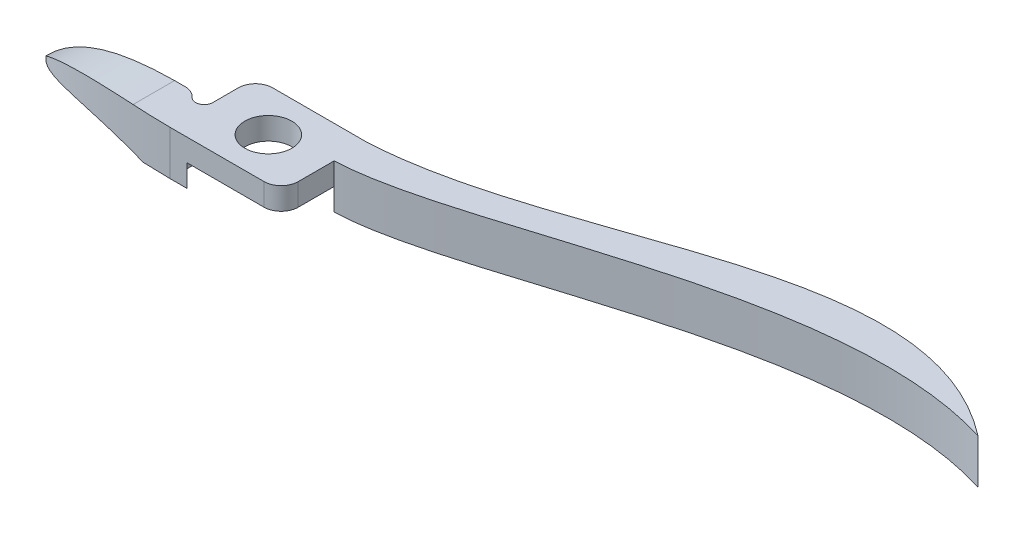
ISO-10303-21;
HEADER;
FILE_DESCRIPTION(('STEP AP214'),'2;1');
FILE_NAME('part.step','',(''),(''),'','','');
FILE_SCHEMA(('AUTOMOTIVE_DESIGN { 1 0 10303 214 1 1 1 1 }'));
ENDSEC;
DATA;
#1=APPLICATION_CONTEXT('core data for automotive mechanical design processes');
#2=APPLICATION_PROTOCOL_DEFINITION('international standard','automotive_design',2000,#1);
#3=PRODUCT_CONTEXT('',#1,'mechanical');
#4=PRODUCT('Part','Part','',(#3));
#5=PRODUCT_RELATED_PRODUCT_CATEGORY('part','',(#4));
#6=PRODUCT_DEFINITION_FORMATION('','',#4);
#7=PRODUCT_DEFINITION_CONTEXT('part definition',#1,'design');
#8=PRODUCT_DEFINITION('design','',#6,#7);
#9=PRODUCT_DEFINITION_SHAPE('','',#8);
#10=(LENGTH_UNIT() NAMED_UNIT(*) SI_UNIT(.MILLI.,.METRE.));
#11=(NAMED_UNIT(*) PLANE_ANGLE_UNIT() SI_UNIT($,.RADIAN.));
#12=(NAMED_UNIT(*) SI_UNIT($,.STERADIAN.) SOLID_ANGLE_UNIT());
#13=UNCERTAINTY_MEASURE_WITH_UNIT(LENGTH_MEASURE(1.E-05),#10,'distance_accuracy_value','');
#14=(GEOMETRIC_REPRESENTATION_CONTEXT(3) GLOBAL_UNCERTAINTY_ASSIGNED_CONTEXT((#13)) GLOBAL_UNIT_ASSIGNED_CONTEXT((#10,
#11,#12)) REPRESENTATION_CONTEXT('',''));
#15=CARTESIAN_POINT('',(0.,0.,0.));
#16=DIRECTION('',(0.,0.,1.));
#17=DIRECTION('',(1.,0.,0.));
#18=AXIS2_PLACEMENT_3D('',#15,#16,#17);
#19=CARTESIAN_POINT('',(-33.02,3.302,0.));
#20=CARTESIAN_POINT('',(-27.473096432597,3.302,6.22315986098551));
#21=CARTESIAN_POINT('',(-8.25499999999994,3.302,6.35));
#22=B_SPLINE_CURVE_WITH_KNOTS('',2,(#19,#20,#21),.UNSPECIFIED.,.F.,.F.,(3,3),(0.,1.),.UNSPECIFIED.);
#23=DIRECTION('',(0.,-1.,0.));
#24=VECTOR('',#23,1.);
#25=SURFACE_OF_LINEAR_EXTRUSION('',#22,#24);
#26=CARTESIAN_POINT('',(-33.02,-3.302,0.));
#27=CARTESIAN_POINT('',(-32.8493555262715,-3.23191102492854,0.191455572994813));
#28=CARTESIAN_POINT('',(-32.6712803221036,-3.16155099042531,0.376019685814025));
#29=CARTESIAN_POINT('',(-32.3025351047692,-3.02195048612788,0.731394631001662));
#30=CARTESIAN_POINT('',(-32.1119030977583,-2.95270736218043,0.90224378043286));
#31=CARTESIAN_POINT('',(-31.7194535669216,-2.81663188346119,1.23119449922115));
#32=CARTESIAN_POINT('',(-31.5176448250329,-2.74979770220064,1.38930584388313));
#33=CARTESIAN_POINT('',(-31.1068493182955,-2.62039434555366,1.69168586506872));
#34=CARTESIAN_POINT('',(-30.8979869134394,-2.55778164907948,1.8361053594339));
#35=CARTESIAN_POINT('',(-30.4718438568277,-2.43668640106267,2.11414393303659));
#36=CARTESIAN_POINT('',(-30.2545575546513,-2.37820669867898,2.247755570668));
#37=CARTESIAN_POINT('',(-29.8127787966357,-2.26602928752205,2.50482036263928));
#38=CARTESIAN_POINT('',(-29.5882838594076,-2.21233324993849,2.62826996570179));
#39=CARTESIAN_POINT('',(-29.0436517980687,-2.09013085422312,2.91235027700613));
#40=CARTESIAN_POINT('',(-28.7206197167618,-2.02410391595905,3.06851212350615));
#41=CARTESIAN_POINT('',(-28.0650059223243,-1.90314649690615,3.364153441573));
#42=CARTESIAN_POINT('',(-27.7324231650492,-1.84821723470581,3.50363108043291));
#43=CARTESIAN_POINT('',(-27.0596615216333,-1.74995444906151,3.76752460909254));
#44=CARTESIAN_POINT('',(-26.7194822372107,-1.70662153516172,3.89193970696487));
#45=CARTESIAN_POINT('',(-26.0307843289083,-1.63155871849199,4.12798692476388));
#46=CARTESIAN_POINT('',(-25.6822239339008,-1.59991238080401,4.23952320494405));
#47=CARTESIAN_POINT('',(-24.98053310519,-1.54876460290087,4.4501245389337));
#48=CARTESIAN_POINT('',(-24.6274031652878,-1.52926186141048,4.54919092807529));
#49=CARTESIAN_POINT('',(-23.9177111112223,-1.50240526794628,4.73606166228489));
#50=CARTESIAN_POINT('',(-23.5611487003343,-1.49505247595175,4.82386502413376));
#51=CARTESIAN_POINT('',(-22.6870108133602,-1.49188291053913,5.02593894914872));
#52=CARTESIAN_POINT('',(-22.1681212620189,-1.50262419495208,5.13469000922816));
#53=CARTESIAN_POINT('',(-21.1277968536637,-1.54914823001965,5.33374447517758));
#54=CARTESIAN_POINT('',(-20.6063611222535,-1.58494028706327,5.42404100905893));
#55=CARTESIAN_POINT('',(-19.5630919705991,-1.68143571779502,5.5885115446547));
#56=CARTESIAN_POINT('',(-19.0412584760049,-1.7421472613305,5.66268024665257));
#57=CARTESIAN_POINT('',(-18.0006763670951,-1.88827112310195,5.79667613792715));
#58=CARTESIAN_POINT('',(-17.4819232322313,-1.97361671213449,5.85654128271921));
#59=CARTESIAN_POINT('',(-16.4480455959767,-2.16921986273426,5.96387183841822));
#60=CARTESIAN_POINT('',(-15.9329198756559,-2.27946859934874,6.0113416290622));
#61=CARTESIAN_POINT('',(-14.9081383333329,-2.5252648857633,6.09536661321178));
#62=CARTESIAN_POINT('',(-14.3984793688402,-2.6607969752344,6.13192844142135));
#63=CARTESIAN_POINT('',(-13.6356505078139,-2.88471043582377,6.1798165038079));
#64=CARTESIAN_POINT('',(-13.3798295603584,-2.96342220284527,6.19470082326831));
#65=CARTESIAN_POINT('',(-12.8705555695267,-3.12759897118467,6.22214369241537));
#66=CARTESIAN_POINT('',(-12.6171001976962,-3.21305632055196,6.23470482485006));
#67=CARTESIAN_POINT('',(-12.3648063314247,-3.302,6.24619087496427));
#68=B_SPLINE_CURVE_WITH_KNOTS('',3,(#26,#27,#28,#29,#30,#31,#32,#33,#34,#35,#36,#37,#38,#39,#40,
#41,#42,#43,#44,#45,#46,#47,#48,#49,#50,#51,#52,#53,#54,#55,#56,#57,#58,#59,#60,#61,#62,#63,#64,
#65,#66,#67),.UNSPECIFIED.,.F.,.F.,(4,2,2,2,2,2,2,2,2,2,2,2,2,2,2,2,2,2,2,2,4),(0.,
0.797243659925846,1.5921762728664,2.38649290558763,3.17067983147115,3.9554021825044,
4.74039761265006,5.8340846084721,6.92789163220799,8.02175613893644,9.12329746767479,
10.2247207378736,11.3262400927683,12.9160146384745,14.5063801008409,16.0972673811179,
17.683885039876,19.2699413270169,20.8550309286911,21.6591486739592,22.4623670151177),.UNSPECIFIED.);
#69=CARTESIAN_POINT('',(-33.02,-3.302,0.));
#70=VERTEX_POINT('',#69);
#71=CARTESIAN_POINT('',(-12.3648063314247,-3.302,6.24619087474405));
#72=VERTEX_POINT('',#71);
#73=EDGE_CURVE('E367',#70,#72,#68,.T.);
#74=ORIENTED_EDGE('',*,*,#73,.T.);
#75=CARTESIAN_POINT('',(-33.02,-3.302,0.));
#76=CARTESIAN_POINT('',(-27.473096432597,-3.302,6.22315986098551));
#77=CARTESIAN_POINT('',(-8.25499999999994,-3.302,6.35));
#78=B_SPLINE_CURVE_WITH_KNOTS('',2,(#75,#76,#77),.UNSPECIFIED.,.F.,.F.,(3,3),(0.,1.),.UNSPECIFIED.);
#79=CARTESIAN_POINT('',(-8.255,-3.302,6.35));
#80=VERTEX_POINT('',#79);
#81=EDGE_CURVE('E230',#72,#80,#78,.T.);
#82=ORIENTED_EDGE('',*,*,#81,.T.);
#83=DIRECTION('',(0.,-1.,0.));
#84=VECTOR('',#83,1.);
#85=CARTESIAN_POINT('',(-8.255,3.302,6.35));
#86=LINE('',#85,#84);
#87=CARTESIAN_POINT('',(-8.255,3.302,6.35));
#88=VERTEX_POINT('',#87);
#89=EDGE_CURVE('E12',#88,#80,#86,.T.);
#90=ORIENTED_EDGE('',*,*,#89,.F.);
#91=CARTESIAN_POINT('',(-13.9218789110866,3.302,6.16184275451109));
#92=VERTEX_POINT('',#91);
#93=EDGE_CURVE('E119',#92,#88,#22,.T.);
#94=ORIENTED_EDGE('',*,*,#93,.F.);
#95=CARTESIAN_POINT('',(-13.9218789124482,3.30199999999994,6.16184275442513));
#96=CARTESIAN_POINT('',(-14.2757671587917,3.29807497459123,6.13949608522975));
#97=CARTESIAN_POINT('',(-14.6295015111341,3.29136135651999,6.11493106148992));
#98=CARTESIAN_POINT('',(-15.3366087323922,3.27172918300036,6.06100204686159));
#99=CARTESIAN_POINT('',(-15.6899813289981,3.25880749965579,6.03163564175186));
#100=CARTESIAN_POINT('',(-16.3959994084621,3.22613203775718,5.96775932544116));
#101=CARTESIAN_POINT('',(-16.7486447916846,3.20637737843231,5.93324875148313));
#102=CARTESIAN_POINT('',(-17.4580411622674,3.15900622958598,5.85814840924013));
#103=CARTESIAN_POINT('',(-17.8147761088024,3.13127821935011,5.81747658076509));
#104=CARTESIAN_POINT('',(-18.5267113011566,3.06732813468706,5.73000297352161));
#105=CARTESIAN_POINT('',(-18.8819116829497,3.03110682923011,5.6832017498687));
#106=CARTESIAN_POINT('',(-19.5903436081505,2.94936608040122,5.58298672496345));
#107=CARTESIAN_POINT('',(-19.9435748942931,2.90384545001304,5.52957207988138));
#108=CARTESIAN_POINT('',(-20.9588693978903,2.75792312557478,5.36521976693141));
#109=CARTESIAN_POINT('',(-21.6177092734333,2.64459484661716,5.24519587284131));
#110=CARTESIAN_POINT('',(-22.9212409606309,2.37628903121111,4.97615102574847));
#111=CARTESIAN_POINT('',(-23.5659305656395,2.22130504803414,4.82712558538847));
#112=CARTESIAN_POINT('',(-24.5148456016645,1.95450407200476,4.5794789719765));
#113=CARTESIAN_POINT('',(-24.827281708654,1.86016099940604,4.49318678844737));
#114=CARTESIAN_POINT('',(-25.4457787481901,1.65954853111274,4.31201146063032));
#115=CARTESIAN_POINT('',(-25.7518401045091,1.55327993120707,4.2171288896594));
#116=CARTESIAN_POINT('',(-26.3562691562426,1.3285915750584,4.01837020127277));
#117=CARTESIAN_POINT('',(-26.6546415329946,1.2101794419542,3.91449973235874));
#118=CARTESIAN_POINT('',(-27.2427587399877,0.96105209364033,3.69724172298386));
#119=CARTESIAN_POINT('',(-27.5325013541418,0.830333753500432,3.58385176602319));
#120=CARTESIAN_POINT('',(-28.218188902479,0.501000832942753,3.29886873251786));
#121=CARTESIAN_POINT('',(-28.6092813352912,0.296430002012325,3.12239130748748));
#122=CARTESIAN_POINT('',(-29.3683118481942,-0.135187222642011,2.74855160140704));
#123=CARTESIAN_POINT('',(-29.736257799875,-0.362225907233564,2.55119648228405));
#124=CARTESIAN_POINT('',(-30.209246604749,-0.677854162499141,2.27328886095922));
#125=CARTESIAN_POINT('',(-30.326002609069,-0.757819711930135,2.20259678842238));
#126=CARTESIAN_POINT('',(-30.5564976798568,-0.919752956621392,2.05868065779664));
#127=CARTESIAN_POINT('',(-30.6702372341323,-1.00172032398679,1.98545701356958));
#128=CARTESIAN_POINT('',(-31.0067870383155,-1.25039514132633,1.76188373463237));
#129=CARTESIAN_POINT('',(-31.2249605511133,-1.41989678983368,1.60761294884932));
#130=CARTESIAN_POINT('',(-31.6480344075935,-1.76467540864734,1.28806972880975));
#131=CARTESIAN_POINT('',(-31.8529425468534,-1.93994889398182,1.12280387390457));
#132=CARTESIAN_POINT('',(-32.1371239105262,-2.19432896995792,0.877014181604712));
#133=CARTESIAN_POINT('',(-32.2220217739333,-2.27186889567472,0.801317318518548));
#134=CARTESIAN_POINT('',(-32.3891206021983,-2.42748608680543,0.64758228583718));
#135=CARTESIAN_POINT('',(-32.4713221307051,-2.50556323573488,0.569544612185622));
#136=CARTESIAN_POINT('',(-32.7136458577688,-2.74013854204914,0.331907773391245));
#137=CARTESIAN_POINT('',(-32.86967332583,-2.89714783756021,0.168624454743414));
#138=CARTESIAN_POINT('',(-33.02,-3.05399492699543,0.));
#139=B_SPLINE_CURVE_WITH_KNOTS('',3,(#95,#96,#97,#98,#99,#100,#101,#102,#103,#104,#105,#106,
#107,#108,#109,#110,#111,#112,#113,#114,#115,#116,#117,#118,#119,#120,#121,#122,#123,#124,#125,
#126,#127,#128,#129,#130,#131,#132,#133,#134,#135,#136,#137,#138),.UNSPECIFIED.,.F.,.F.,(4,2,2,
2,2,2,2,2,2,2,2,2,2,2,2,2,2,2,2,2,2,4),(0.,1.06385184780087,2.12824027395346,3.19276595097234,
4.27297241019061,5.35308110686969,6.4333277607209,8.46918290407192,10.5053533024515,
11.5177893215878,12.5301578211261,13.5418946489719,14.5538890849416,15.9783987495692,
17.4024213224398,17.8769451441653,18.3513917540917,19.300156233718,20.2483580006092,
20.6612981518337,21.0741514236181,21.8989675965163),.UNSPECIFIED.);
#140=CARTESIAN_POINT('',(-33.02,-3.05399492699542,0.));
#141=VERTEX_POINT('',#140);
#142=EDGE_CURVE('E77',#92,#141,#139,.T.);
#143=ORIENTED_EDGE('',*,*,#142,.T.);
#144=DIRECTION('',(0.,-1.,0.));
#145=VECTOR('',#144,1.);
#146=CARTESIAN_POINT('',(-33.02,3.302,0.));
#147=LINE('',#146,#145);
#148=EDGE_CURVE('E183',#141,#70,#147,.T.);
#149=ORIENTED_EDGE('',*,*,#148,.T.);
#150=EDGE_LOOP('',(#74,#82,#90,#94,#143,#149));
#151=FACE_BOUND('',#150,.T.);
#152=ADVANCED_FACE('F60',(#151),#25,.F.);
#153=CARTESIAN_POINT('',(0.,3.302,0.));
#154=DIRECTION('',(0.,0.,1.));
#155=DIRECTION('',(1.,0.,0.));
#156=AXIS2_PLACEMENT_3D('',#153,#154,#155);
#157=PLANE('',#156);
#158=CARTESIAN_POINT('',(-12.3648063314247,-3.302,0.));
#159=CARTESIAN_POINT('',(-18.8048744708733,-1.03148335701843,0.));
#160=CARTESIAN_POINT('',(-26.8124714422319,-0.753963495491612,0.));
#161=CARTESIAN_POINT('',(-33.02,-3.30200000000001,0.));
#162=B_SPLINE_CURVE_WITH_KNOTS('',3,(#158,#159,#160,#161),.UNSPECIFIED.,.F.,.F.,(4,4),(0.,1.),.UNSPECIFIED.);
#163=CARTESIAN_POINT('',(-12.3648063314247,-3.302,0.));
#164=VERTEX_POINT('',#163);
#165=EDGE_CURVE('E378',#164,#70,#162,.T.);
#166=ORIENTED_EDGE('',*,*,#165,.T.);
#167=ORIENTED_EDGE('',*,*,#148,.F.);
#168=CARTESIAN_POINT('',(-33.02,-3.05399492699543,0.));
#169=CARTESIAN_POINT('',(-28.2378330119546,1.93464903660238,0.));
#170=CARTESIAN_POINT('',(-21.2907050841812,3.39591165007092,0.));
#171=CARTESIAN_POINT('',(-12.3648063314247,3.302,0.));
#172=B_SPLINE_CURVE_WITH_KNOTS('',3,(#168,#169,#170,#171),.UNSPECIFIED.,.F.,.F.,(4,4),(0.,1.),.UNSPECIFIED.);
#173=CARTESIAN_POINT('',(-13.9218789124441,3.302,0.));
#174=VERTEX_POINT('',#173);
#175=EDGE_CURVE('E209',#141,#174,#172,.T.);
#176=ORIENTED_EDGE('',*,*,#175,.T.);
#177=DIRECTION('',(-1.,0.,0.));
#178=VECTOR('',#177,1.);
#179=CARTESIAN_POINT('',(0.,3.302,0.));
#180=LINE('',#179,#178);
#181=CARTESIAN_POINT('',(-12.3648063314247,3.302,0.));
#182=VERTEX_POINT('',#181);
#183=EDGE_CURVE('E175',#182,#174,#180,.T.);
#184=ORIENTED_EDGE('',*,*,#183,.F.);
#185=DIRECTION('',(0.,-1.,0.));
#186=VECTOR('',#185,1.);
#187=CARTESIAN_POINT('',(-12.3648063314247,3.302,0.));
#188=LINE('',#187,#186);
#189=EDGE_CURVE('E86',#182,#164,#188,.T.);
#190=ORIENTED_EDGE('',*,*,#189,.T.);
#191=EDGE_LOOP('',(#166,#167,#176,#184,#190));
#192=FACE_BOUND('',#191,.T.);
#193=ADVANCED_FACE('F357',(#192),#157,.F.);
#194=CARTESIAN_POINT('',(0.,-3.302,0.));
#195=DIRECTION('',(0.,1.,0.));
#196=DIRECTION('',(0.,0.,1.));
#197=AXIS2_PLACEMENT_3D('',#194,#195,#196);
#198=PLANE('',#197);
#199=DIRECTION('',(0.,0.,-1.));
#200=VECTOR('',#199,1.);
#201=CARTESIAN_POINT('',(-12.3648063314247,-3.302,6.351));
#202=LINE('',#201,#200);
#203=EDGE_CURVE('E218',#72,#164,#202,.T.);
#204=ORIENTED_EDGE('',*,*,#203,.T.);
#205=CARTESIAN_POINT('',(-12.3648063314247,-3.302,2.54));
#206=DIRECTION('',(0.,1.,0.));
#207=DIRECTION('',(0.,0.,1.));
#208=AXIS2_PLACEMENT_3D('',#205,#206,#207);
#209=CIRCLE('',#208,2.54);
#210=CARTESIAN_POINT('',(-10.4716021104749,-3.302,0.846666666666668));
#211=VERTEX_POINT('',#210);
#212=EDGE_CURVE('E253',#164,#211,#209,.F.);
#213=ORIENTED_EDGE('',*,*,#212,.T.);
#214=CARTESIAN_POINT('',(-9.525,-3.302,0.));
#215=DIRECTION('',(0.,1.,0.));
#216=DIRECTION('',(0.,0.,1.));
#217=AXIS2_PLACEMENT_3D('',#214,#215,#216);
#218=CIRCLE('',#217,1.27);
#219=CARTESIAN_POINT('',(-8.255,-3.302,0.));
#220=VERTEX_POINT('',#219);
#221=EDGE_CURVE('E250',#211,#220,#218,.T.);
#222=ORIENTED_EDGE('',*,*,#221,.T.);
#223=DIRECTION('',(0.,0.,1.));
#224=VECTOR('',#223,1.);
#225=CARTESIAN_POINT('',(-8.255,-3.302,0.));
#226=LINE('',#225,#224);
#227=CARTESIAN_POINT('',(-8.255,-3.302,3.80999999999998));
#228=VERTEX_POINT('',#227);
#229=EDGE_CURVE('E247',#220,#228,#226,.T.);
#230=ORIENTED_EDGE('',*,*,#229,.T.);
#231=CARTESIAN_POINT('',(-5.715,-3.302,3.81));
#232=DIRECTION('',(0.,1.,0.));
#233=DIRECTION('',(0.,0.,1.));
#234=AXIS2_PLACEMENT_3D('',#231,#232,#233);
#235=CIRCLE('',#234,2.54);
#236=CARTESIAN_POINT('',(-5.71499999999998,-3.302,6.35));
#237=VERTEX_POINT('',#236);
#238=EDGE_CURVE('E244',#228,#237,#235,.T.);
#239=ORIENTED_EDGE('',*,*,#238,.T.);
#240=DIRECTION('',(-1.,0.,0.));
#241=VECTOR('',#240,1.);
#242=CARTESIAN_POINT('',(0.,-3.302,6.35));
#243=LINE('',#242,#241);
#244=EDGE_CURVE('E238',#237,#80,#243,.T.);
#245=ORIENTED_EDGE('',*,*,#244,.T.);
#246=ORIENTED_EDGE('',*,*,#81,.F.);
#247=EDGE_LOOP('',(#204,#213,#222,#230,#239,#245,#246));
#248=FACE_BOUND('',#247,.T.);
#249=ADVANCED_FACE('F362',(#248),#198,.F.);
#250=CARTESIAN_POINT('',(0.,3.302,0.));
#251=DIRECTION('',(0.,1.,0.));
#252=DIRECTION('',(0.,0.,1.));
#253=AXIS2_PLACEMENT_3D('',#250,#251,#252);
#254=PLANE('',#253);
#255=CARTESIAN_POINT('',(0.,3.302,0.));
#256=DIRECTION('',(0.,1.,0.));
#257=DIRECTION('',(0.,0.,1.));
#258=AXIS2_PLACEMENT_3D('',#255,#256,#257);
#259=CIRCLE('',#258,3.4925);
#260=CARTESIAN_POINT('',(0.,3.302,3.4925));
#261=VERTEX_POINT('',#260);
#262=EDGE_CURVE('E180',#261,#261,#259,.T.);
#263=ORIENTED_EDGE('',*,*,#262,.F.);
#264=EDGE_LOOP('',(#263));
#265=FACE_BOUND('',#264,.T.);
#266=ORIENTED_EDGE('',*,*,#183,.T.);
#267=DIRECTION('',(0.,0.,-1.));
#268=VECTOR('',#267,1.);
#269=CARTESIAN_POINT('',(-13.9218789124441,3.302,6.351));
#270=LINE('',#269,#268);
#271=EDGE_CURVE('E207',#92,#174,#270,.T.);
#272=ORIENTED_EDGE('',*,*,#271,.F.);
#273=ORIENTED_EDGE('',*,*,#93,.T.);
#274=DIRECTION('',(1.,0.,0.));
#275=VECTOR('',#274,1.);
#276=CARTESIAN_POINT('',(0.,3.302,6.35));
#277=LINE('',#276,#275);
#278=CARTESIAN_POINT('',(5.71499999999998,3.302,6.35));
#279=VERTEX_POINT('',#278);
#280=EDGE_CURVE('E308',#88,#279,#277,.T.);
#281=ORIENTED_EDGE('',*,*,#280,.T.);
#282=CARTESIAN_POINT('',(5.715,3.302,3.81));
#283=DIRECTION('',(0.,1.,0.));
#284=DIRECTION('',(0.,0.,1.));
#285=AXIS2_PLACEMENT_3D('',#282,#283,#284);
#286=CIRCLE('',#285,2.54);
#287=CARTESIAN_POINT('',(8.255,3.302,3.80999999999998));
#288=VERTEX_POINT('',#287);
#289=EDGE_CURVE('E314',#279,#288,#286,.T.);
#290=ORIENTED_EDGE('',*,*,#289,.T.);
#291=DIRECTION('',(0.,0.,1.));
#292=VECTOR('',#291,1.);
#293=CARTESIAN_POINT('',(8.255,3.302,0.));
#294=LINE('',#293,#292);
#295=CARTESIAN_POINT('',(8.255,3.302,-1.524));
#296=VERTEX_POINT('',#295);
#297=EDGE_CURVE('E316',#296,#288,#294,.T.);
#298=ORIENTED_EDGE('',*,*,#297,.F.);
#299=CARTESIAN_POINT('',(8.255,3.302,-1.524));
#300=CARTESIAN_POINT('',(26.9221441817597,3.302,-2.15084961746132));
#301=CARTESIAN_POINT('',(62.6462462616133,3.302,-22.822886737911));
#302=CARTESIAN_POINT('',(91.4400000000001,3.302,-13.97));
#303=B_SPLINE_CURVE_WITH_KNOTS('',3,(#299,#300,#301,#302),.UNSPECIFIED.,.F.,.F.,(4,4),(0.,1.),.UNSPECIFIED.);
#304=CARTESIAN_POINT('',(91.4400000000001,3.302,-13.97));
#305=VERTEX_POINT('',#304);
#306=EDGE_CURVE('E319',#296,#305,#303,.T.);
#307=ORIENTED_EDGE('',*,*,#306,.T.);
#308=CARTESIAN_POINT('',(91.44,3.302,-13.97));
#309=CARTESIAN_POINT('',(66.350363847713,3.302,-33.3520512179018));
#310=CARTESIAN_POINT('',(36.8413371265353,3.302,-7.76465399928655));
#311=CARTESIAN_POINT('',(8.25499999999984,3.302,-6.35));
#312=B_SPLINE_CURVE_WITH_KNOTS('',3,(#308,#309,#310,#311),.UNSPECIFIED.,.F.,.F.,(4,4),(0.,1.),.UNSPECIFIED.);
#313=CARTESIAN_POINT('',(8.255,3.302,-6.35));
#314=VERTEX_POINT('',#313);
#315=EDGE_CURVE('E324',#305,#314,#312,.T.);
#316=ORIENTED_EDGE('',*,*,#315,.T.);
#317=DIRECTION('',(1.,0.,0.));
#318=VECTOR('',#317,1.);
#319=CARTESIAN_POINT('',(0.,3.302,-6.35));
#320=LINE('',#319,#318);
#321=CARTESIAN_POINT('',(-5.71499999999998,3.302,-6.35));
#322=VERTEX_POINT('',#321);
#323=EDGE_CURVE('E435',#322,#314,#320,.T.);
#324=ORIENTED_EDGE('',*,*,#323,.F.);
#325=CARTESIAN_POINT('',(-5.715,3.302,-3.81));
#326=DIRECTION('',(0.,1.,0.));
#327=DIRECTION('',(0.,0.,1.));
#328=AXIS2_PLACEMENT_3D('',#325,#326,#327);
#329=CIRCLE('',#328,2.54);
#330=CARTESIAN_POINT('',(-8.255,3.302,-3.80999999999998));
#331=VERTEX_POINT('',#330);
#332=EDGE_CURVE('E155',#322,#331,#329,.T.);
#333=ORIENTED_EDGE('',*,*,#332,.T.);
#334=DIRECTION('',(0.,0.,1.));
#335=VECTOR('',#334,1.);
#336=CARTESIAN_POINT('',(-8.255,3.302,0.));
#337=LINE('',#336,#335);
#338=CARTESIAN_POINT('',(-8.255,3.302,0.));
#339=VERTEX_POINT('',#338);
#340=EDGE_CURVE('E146',#331,#339,#337,.T.);
#341=ORIENTED_EDGE('',*,*,#340,.T.);
#342=CARTESIAN_POINT('',(-9.525,3.302,0.));
#343=DIRECTION('',(0.,1.,0.));
#344=DIRECTION('',(0.,0.,1.));
#345=AXIS2_PLACEMENT_3D('',#342,#343,#344);
#346=CIRCLE('',#345,1.27);
#347=CARTESIAN_POINT('',(-10.4716021104749,3.302,0.846666666666668));
#348=VERTEX_POINT('',#347);
#349=EDGE_CURVE('E152',#348,#339,#346,.T.);
#350=ORIENTED_EDGE('',*,*,#349,.F.);
#351=CARTESIAN_POINT('',(-12.3648063314247,3.302,2.54));
#352=DIRECTION('',(0.,1.,0.));
#353=DIRECTION('',(0.,0.,1.));
#354=AXIS2_PLACEMENT_3D('',#351,#352,#353);
#355=CIRCLE('',#354,2.54);
#356=EDGE_CURVE('E173',#182,#348,#355,.F.);
#357=ORIENTED_EDGE('',*,*,#356,.F.);
#358=EDGE_LOOP('',(#266,#272,#273,#281,#290,#298,#307,#316,#324,#333,#341,#350,#357));
#359=FACE_BOUND('',#358,.T.);
#360=ADVANCED_FACE('F149',(#265,#359),#254,.T.);
#361=CARTESIAN_POINT('',(0.,0.,0.));
#362=DIRECTION('',(0.,1.,0.));
#363=DIRECTION('',(0.,0.,1.));
#364=AXIS2_PLACEMENT_3D('',#361,#362,#363);
#365=PLANE('',#364);
#366=CARTESIAN_POINT('',(0.,0.,0.));
#367=DIRECTION('',(0.,1.,0.));
#368=DIRECTION('',(0.,0.,1.));
#369=AXIS2_PLACEMENT_3D('',#366,#367,#368);
#370=CIRCLE('',#369,3.4925);
#371=CARTESIAN_POINT('',(0.,0.,3.4925));
#372=VERTEX_POINT('',#371);
#373=EDGE_CURVE('E198',#372,#372,#370,.T.);
#374=ORIENTED_EDGE('',*,*,#373,.T.);
#375=EDGE_LOOP('',(#374));
#376=FACE_BOUND('',#375,.T.);
#377=DIRECTION('',(0.,0.,1.));
#378=VECTOR('',#377,1.);
#379=CARTESIAN_POINT('',(-8.255,0.,0.));
#380=LINE('',#379,#378);
#381=CARTESIAN_POINT('',(-8.255,0.,0.));
#382=VERTEX_POINT('',#381);
#383=CARTESIAN_POINT('',(-8.255,0.,3.80999999999998));
#384=VERTEX_POINT('',#383);
#385=EDGE_CURVE('E213',#382,#384,#380,.T.);
#386=ORIENTED_EDGE('',*,*,#385,.F.);
#387=DIRECTION('',(0.,0.,1.));
#388=VECTOR('',#387,1.);
#389=CARTESIAN_POINT('',(-8.255,0.,0.));
#390=LINE('',#389,#388);
#391=CARTESIAN_POINT('',(-8.255,0.,-3.80999999999998));
#392=VERTEX_POINT('',#391);
#393=EDGE_CURVE('E164',#392,#382,#390,.T.);
#394=ORIENTED_EDGE('',*,*,#393,.F.);
#395=CARTESIAN_POINT('',(-5.715,0.,-3.81));
#396=DIRECTION('',(0.,1.,0.));
#397=DIRECTION('',(0.,0.,1.));
#398=AXIS2_PLACEMENT_3D('',#395,#396,#397);
#399=CIRCLE('',#398,2.54);
#400=CARTESIAN_POINT('',(-5.71499999999998,0.,-6.35));
#401=VERTEX_POINT('',#400);
#402=EDGE_CURVE('E111',#401,#392,#399,.T.);
#403=ORIENTED_EDGE('',*,*,#402,.F.);
#404=DIRECTION('',(1.,0.,0.));
#405=VECTOR('',#404,1.);
#406=CARTESIAN_POINT('',(0.,0.,-6.35));
#407=LINE('',#406,#405);
#408=CARTESIAN_POINT('',(5.71499999999998,0.,-6.35));
#409=VERTEX_POINT('',#408);
#410=EDGE_CURVE('E193',#401,#409,#407,.T.);
#411=ORIENTED_EDGE('',*,*,#410,.T.);
#412=CARTESIAN_POINT('',(5.715,0.,-3.81));
#413=DIRECTION('',(0.,1.,0.));
#414=DIRECTION('',(0.,0.,1.));
#415=AXIS2_PLACEMENT_3D('',#412,#413,#414);
#416=CIRCLE('',#415,2.54);
#417=CARTESIAN_POINT('',(8.255,0.,-3.80999999999998));
#418=VERTEX_POINT('',#417);
#419=EDGE_CURVE('E262',#409,#418,#416,.F.);
#420=ORIENTED_EDGE('',*,*,#419,.T.);
#421=DIRECTION('',(0.,0.,1.));
#422=VECTOR('',#421,1.);
#423=CARTESIAN_POINT('',(8.255,0.,0.));
#424=LINE('',#423,#422);
#425=CARTESIAN_POINT('',(8.255,0.,-1.524));
#426=VERTEX_POINT('',#425);
#427=EDGE_CURVE('E274',#418,#426,#424,.T.);
#428=ORIENTED_EDGE('',*,*,#427,.T.);
#429=DIRECTION('',(0.,0.,1.));
#430=VECTOR('',#429,1.);
#431=CARTESIAN_POINT('',(8.255,0.,0.));
#432=LINE('',#431,#430);
#433=CARTESIAN_POINT('',(8.255,0.,3.80999999999998));
#434=VERTEX_POINT('',#433);
#435=EDGE_CURVE('E190',#426,#434,#432,.T.);
#436=ORIENTED_EDGE('',*,*,#435,.T.);
#437=CARTESIAN_POINT('',(5.715,0.,3.81));
#438=DIRECTION('',(0.,1.,0.));
#439=DIRECTION('',(0.,0.,1.));
#440=AXIS2_PLACEMENT_3D('',#437,#438,#439);
#441=CIRCLE('',#440,2.54);
#442=CARTESIAN_POINT('',(5.71499999999998,0.,6.35));
#443=VERTEX_POINT('',#442);
#444=EDGE_CURVE('E186',#443,#434,#441,.T.);
#445=ORIENTED_EDGE('',*,*,#444,.F.);
#446=DIRECTION('',(1.,0.,0.));
#447=VECTOR('',#446,1.);
#448=CARTESIAN_POINT('',(0.,0.,6.35));
#449=LINE('',#448,#447);
#450=CARTESIAN_POINT('',(-5.71499999999998,0.,6.35));
#451=VERTEX_POINT('',#450);
#452=EDGE_CURVE('E184',#451,#443,#449,.T.);
#453=ORIENTED_EDGE('',*,*,#452,.F.);
#454=CARTESIAN_POINT('',(-5.715,0.,3.81));
#455=DIRECTION('',(0.,1.,0.));
#456=DIRECTION('',(0.,0.,1.));
#457=AXIS2_PLACEMENT_3D('',#454,#455,#456);
#458=CIRCLE('',#457,2.54);
#459=EDGE_CURVE('E208',#384,#451,#458,.T.);
#460=ORIENTED_EDGE('',*,*,#459,.F.);
#461=EDGE_LOOP('',(#386,#394,#403,#411,#420,#428,#436,#445,#453,#460));
#462=FACE_BOUND('',#461,.T.);
#463=ADVANCED_FACE('F349',(#376,#462),#365,.F.);
#464=CARTESIAN_POINT('',(0.,3.302,6.35));
#465=DIRECTION('',(0.,0.,-1.));
#466=DIRECTION('',(-1.,0.,0.));
#467=AXIS2_PLACEMENT_3D('',#464,#465,#466);
#468=PLANE('',#467);
#469=ORIENTED_EDGE('',*,*,#89,.T.);
#470=ORIENTED_EDGE('',*,*,#244,.F.);
#471=DIRECTION('',(0.,1.,0.));
#472=VECTOR('',#471,1.);
#473=CARTESIAN_POINT('',(-5.71499999999998,-3.302,6.35));
#474=LINE('',#473,#472);
#475=EDGE_CURVE('E255',#237,#451,#474,.T.);
#476=ORIENTED_EDGE('',*,*,#475,.T.);
#477=ORIENTED_EDGE('',*,*,#452,.T.);
#478=DIRECTION('',(0.,-1.,0.));
#479=VECTOR('',#478,1.);
#480=CARTESIAN_POINT('',(5.71499999999998,3.302,6.35));
#481=LINE('',#480,#479);
#482=EDGE_CURVE('E69',#279,#443,#481,.T.);
#483=ORIENTED_EDGE('',*,*,#482,.F.);
#484=ORIENTED_EDGE('',*,*,#280,.F.);
#485=EDGE_LOOP('',(#469,#470,#476,#477,#483,#484));
#486=FACE_BOUND('',#485,.T.);
#487=ADVANCED_FACE('F346',(#486),#468,.F.);
#488=CARTESIAN_POINT('',(5.715,3.302,3.81));
#489=DIRECTION('',(0.,-1.,0.));
#490=DIRECTION('',(0.,0.,-1.));
#491=AXIS2_PLACEMENT_3D('',#488,#489,#490);
#492=CYLINDRICAL_SURFACE('',#491,2.54);
#493=ORIENTED_EDGE('',*,*,#444,.T.);
#494=DIRECTION('',(0.,-1.,0.));
#495=VECTOR('',#494,1.);
#496=CARTESIAN_POINT('',(8.255,3.302,3.80999999999998));
#497=LINE('',#496,#495);
#498=EDGE_CURVE('E453',#288,#434,#497,.T.);
#499=ORIENTED_EDGE('',*,*,#498,.F.);
#500=ORIENTED_EDGE('',*,*,#289,.F.);
#501=ORIENTED_EDGE('',*,*,#482,.T.);
#502=EDGE_LOOP('',(#493,#499,#500,#501));
#503=FACE_BOUND('',#502,.T.);
#504=ADVANCED_FACE('F343',(#503),#492,.T.);
#505=CARTESIAN_POINT('',(8.255,3.302,0.));
#506=DIRECTION('',(1.,0.,0.));
#507=DIRECTION('',(0.,0.,-1.));
#508=AXIS2_PLACEMENT_3D('',#505,#506,#507);
#509=PLANE('',#508);
#510=ORIENTED_EDGE('',*,*,#435,.F.);
#511=DIRECTION('',(0.,-1.,0.));
#512=VECTOR('',#511,1.);
#513=CARTESIAN_POINT('',(8.255,3.302,-1.524));
#514=LINE('',#513,#512);
#515=EDGE_CURVE('E448',#296,#426,#514,.T.);
#516=ORIENTED_EDGE('',*,*,#515,.F.);
#517=ORIENTED_EDGE('',*,*,#297,.T.);
#518=ORIENTED_EDGE('',*,*,#498,.T.);
#519=EDGE_LOOP('',(#510,#516,#517,#518));
#520=FACE_BOUND('',#519,.T.);
#521=ADVANCED_FACE('F338',(#520),#509,.T.);
#522=DIRECTION('',(0.,-1.,0.));
#523=VECTOR('',#522,1.);
#524=SURFACE_OF_LINEAR_EXTRUSION('',#303,#523);
#525=ORIENTED_EDGE('',*,*,#515,.T.);
#526=DIRECTION('',(0.,1.,0.));
#527=VECTOR('',#526,1.);
#528=CARTESIAN_POINT('',(8.255,-3.302,-1.524));
#529=LINE('',#528,#527);
#530=CARTESIAN_POINT('',(8.255,-3.302,-1.524));
#531=VERTEX_POINT('',#530);
#532=EDGE_CURVE('E187',#531,#426,#529,.T.);
#533=ORIENTED_EDGE('',*,*,#532,.F.);
#534=CARTESIAN_POINT('',(8.255,-3.302,-1.524));
#535=CARTESIAN_POINT('',(26.9221441817597,-3.302,-2.15084961746132));
#536=CARTESIAN_POINT('',(62.6462462616133,-3.302,-22.822886737911));
#537=CARTESIAN_POINT('',(91.4400000000001,-3.302,-13.97));
#538=B_SPLINE_CURVE_WITH_KNOTS('',3,(#534,#535,#536,#537),.UNSPECIFIED.,.F.,.F.,(4,4),(0.,1.),.UNSPECIFIED.);
#539=CARTESIAN_POINT('',(91.4400000000001,-3.302,-13.97));
#540=VERTEX_POINT('',#539);
#541=EDGE_CURVE('E268',#531,#540,#538,.T.);
#542=ORIENTED_EDGE('',*,*,#541,.T.);
#543=DIRECTION('',(0.,-1.,0.));
#544=VECTOR('',#543,1.);
#545=CARTESIAN_POINT('',(91.4400000000001,3.302,-13.97));
#546=LINE('',#545,#544);
#547=EDGE_CURVE('E446',#305,#540,#546,.T.);
#548=ORIENTED_EDGE('',*,*,#547,.F.);
#549=ORIENTED_EDGE('',*,*,#306,.F.);
#550=EDGE_LOOP('',(#525,#533,#542,#548,#549));
#551=FACE_BOUND('',#550,.T.);
#552=ADVANCED_FACE('F333',(#551),#524,.F.);
#553=DIRECTION('',(0.,-1.,0.));
#554=VECTOR('',#553,1.);
#555=SURFACE_OF_LINEAR_EXTRUSION('',#312,#554);
#556=ORIENTED_EDGE('',*,*,#547,.T.);
#557=CARTESIAN_POINT('',(91.44,-3.302,-13.97));
#558=CARTESIAN_POINT('',(66.350363847713,-3.302,-33.3520512179018));
#559=CARTESIAN_POINT('',(36.8413371265353,-3.302,-7.76465399928655));
#560=CARTESIAN_POINT('',(8.25499999999984,-3.302,-6.35));
#561=B_SPLINE_CURVE_WITH_KNOTS('',3,(#557,#558,#559,#560),.UNSPECIFIED.,.F.,.F.,(4,4),(0.,1.),.UNSPECIFIED.);
#562=CARTESIAN_POINT('',(8.255,-3.302,-6.35));
#563=VERTEX_POINT('',#562);
#564=EDGE_CURVE('E273',#540,#563,#561,.T.);
#565=ORIENTED_EDGE('',*,*,#564,.T.);
#566=DIRECTION('',(0.,-1.,0.));
#567=VECTOR('',#566,1.);
#568=CARTESIAN_POINT('',(8.255,3.302,-6.35));
#569=LINE('',#568,#567);
#570=EDGE_CURVE('E436',#314,#563,#569,.T.);
#571=ORIENTED_EDGE('',*,*,#570,.F.);
#572=ORIENTED_EDGE('',*,*,#315,.F.);
#573=EDGE_LOOP('',(#556,#565,#571,#572));
#574=FACE_BOUND('',#573,.T.);
#575=ADVANCED_FACE('F337',(#574),#555,.F.);
#576=CARTESIAN_POINT('',(0.,3.302,-6.35));
#577=DIRECTION('',(0.,0.,-1.));
#578=DIRECTION('',(-1.,0.,0.));
#579=AXIS2_PLACEMENT_3D('',#576,#577,#578);
#580=PLANE('',#579);
#581=ORIENTED_EDGE('',*,*,#410,.F.);
#582=DIRECTION('',(0.,-1.,0.));
#583=VECTOR('',#582,1.);
#584=CARTESIAN_POINT('',(-5.71499999999998,3.302,-6.35));
#585=LINE('',#584,#583);
#586=EDGE_CURVE('E434',#322,#401,#585,.T.);
#587=ORIENTED_EDGE('',*,*,#586,.F.);
#588=ORIENTED_EDGE('',*,*,#323,.T.);
#589=ORIENTED_EDGE('',*,*,#570,.T.);
#590=DIRECTION('',(1.,0.,0.));
#591=VECTOR('',#590,1.);
#592=CARTESIAN_POINT('',(0.,-3.302,-6.35));
#593=LINE('',#592,#591);
#594=CARTESIAN_POINT('',(5.71499999999998,-3.302,-6.35));
#595=VERTEX_POINT('',#594);
#596=EDGE_CURVE('E282',#595,#563,#593,.T.);
#597=ORIENTED_EDGE('',*,*,#596,.F.);
#598=DIRECTION('',(0.,1.,0.));
#599=VECTOR('',#598,1.);
#600=CARTESIAN_POINT('',(5.71499999999998,-3.302,-6.35));
#601=LINE('',#600,#599);
#602=EDGE_CURVE('E294',#595,#409,#601,.T.);
#603=ORIENTED_EDGE('',*,*,#602,.T.);
#604=EDGE_LOOP('',(#581,#587,#588,#589,#597,#603));
#605=FACE_BOUND('',#604,.T.);
#606=ADVANCED_FACE('F432',(#605),#580,.T.);
#607=CARTESIAN_POINT('',(-5.715,3.302,-3.81));
#608=DIRECTION('',(0.,-1.,0.));
#609=DIRECTION('',(0.,0.,-1.));
#610=AXIS2_PLACEMENT_3D('',#607,#608,#609);
#611=CYLINDRICAL_SURFACE('',#610,2.54);
#612=ORIENTED_EDGE('',*,*,#402,.T.);
#613=DIRECTION('',(0.,-1.,0.));
#614=VECTOR('',#613,1.);
#615=CARTESIAN_POINT('',(-8.255,3.302,-3.80999999999998));
#616=LINE('',#615,#614);
#617=EDGE_CURVE('E167',#331,#392,#616,.T.);
#618=ORIENTED_EDGE('',*,*,#617,.F.);
#619=ORIENTED_EDGE('',*,*,#332,.F.);
#620=ORIENTED_EDGE('',*,*,#586,.T.);
#621=EDGE_LOOP('',(#612,#618,#619,#620));
#622=FACE_BOUND('',#621,.T.);
#623=ADVANCED_FACE('F438',(#622),#611,.T.);
#624=CARTESIAN_POINT('',(-8.255,3.302,0.));
#625=DIRECTION('',(1.,0.,0.));
#626=DIRECTION('',(0.,0.,-1.));
#627=AXIS2_PLACEMENT_3D('',#624,#625,#626);
#628=PLANE('',#627);
#629=ORIENTED_EDGE('',*,*,#393,.T.);
#630=DIRECTION('',(0.,-1.,0.));
#631=VECTOR('',#630,1.);
#632=CARTESIAN_POINT('',(-8.255,3.302,0.));
#633=LINE('',#632,#631);
#634=EDGE_CURVE('E160',#339,#382,#633,.T.);
#635=ORIENTED_EDGE('',*,*,#634,.F.);
#636=ORIENTED_EDGE('',*,*,#340,.F.);
#637=ORIENTED_EDGE('',*,*,#617,.T.);
#638=EDGE_LOOP('',(#629,#635,#636,#637));
#639=FACE_BOUND('',#638,.T.);
#640=ADVANCED_FACE('F161',(#639),#628,.F.);
#641=CARTESIAN_POINT('',(-9.525,3.302,0.));
#642=DIRECTION('',(0.,-1.,0.));
#643=DIRECTION('',(0.,0.,-1.));
#644=AXIS2_PLACEMENT_3D('',#641,#642,#643);
#645=CYLINDRICAL_SURFACE('',#644,1.27);
#646=ORIENTED_EDGE('',*,*,#634,.T.);
#647=DIRECTION('',(0.,1.,0.));
#648=VECTOR('',#647,1.);
#649=CARTESIAN_POINT('',(-8.255,-3.302,0.));
#650=LINE('',#649,#648);
#651=EDGE_CURVE('E259',#220,#382,#650,.T.);
#652=ORIENTED_EDGE('',*,*,#651,.F.);
#653=ORIENTED_EDGE('',*,*,#221,.F.);
#654=DIRECTION('',(0.,-1.,0.));
#655=VECTOR('',#654,1.);
#656=CARTESIAN_POINT('',(-10.4716021104749,3.302,0.846666666666668));
#657=LINE('',#656,#655);
#658=EDGE_CURVE('E168',#348,#211,#657,.T.);
#659=ORIENTED_EDGE('',*,*,#658,.F.);
#660=ORIENTED_EDGE('',*,*,#349,.T.);
#661=EDGE_LOOP('',(#646,#652,#653,#659,#660));
#662=FACE_BOUND('',#661,.T.);
#663=ADVANCED_FACE('F170',(#662),#645,.F.);
#664=CARTESIAN_POINT('',(-12.3648063314247,3.302,2.54));
#665=DIRECTION('',(0.,-1.,0.));
#666=DIRECTION('',(0.,0.,-1.));
#667=AXIS2_PLACEMENT_3D('',#664,#665,#666);
#668=CYLINDRICAL_SURFACE('',#667,2.54);
#669=ORIENTED_EDGE('',*,*,#658,.T.);
#670=ORIENTED_EDGE('',*,*,#212,.F.);
#671=ORIENTED_EDGE('',*,*,#189,.F.);
#672=ORIENTED_EDGE('',*,*,#356,.T.);
#673=EDGE_LOOP('',(#669,#670,#671,#672));
#674=FACE_BOUND('',#673,.T.);
#675=ADVANCED_FACE('F520',(#674),#668,.T.);
#676=CARTESIAN_POINT('',(0.,3.302,0.));
#677=DIRECTION('',(0.,-1.,0.));
#678=DIRECTION('',(0.,0.,-1.));
#679=AXIS2_PLACEMENT_3D('',#676,#677,#678);
#680=CYLINDRICAL_SURFACE('',#679,3.4925);
#681=ORIENTED_EDGE('',*,*,#262,.T.);
#682=EDGE_LOOP('',(#681));
#683=FACE_BOUND('',#682,.T.);
#684=ORIENTED_EDGE('',*,*,#373,.F.);
#685=EDGE_LOOP('',(#684));
#686=FACE_BOUND('',#685,.T.);
#687=ADVANCED_FACE('F513',(#683,#686),#680,.F.);
#688=CARTESIAN_POINT('',(8.255,-3.302,0.));
#689=DIRECTION('',(-1.,0.,0.));
#690=DIRECTION('',(0.,0.,1.));
#691=AXIS2_PLACEMENT_3D('',#688,#689,#690);
#692=PLANE('',#691);
#693=ORIENTED_EDGE('',*,*,#427,.F.);
#694=DIRECTION('',(0.,1.,0.));
#695=VECTOR('',#694,1.);
#696=CARTESIAN_POINT('',(8.255,-3.302,-3.80999999999998));
#697=LINE('',#696,#695);
#698=CARTESIAN_POINT('',(8.255,-3.302,-3.80999999999998));
#699=VERTEX_POINT('',#698);
#700=EDGE_CURVE('E300',#699,#418,#697,.T.);
#701=ORIENTED_EDGE('',*,*,#700,.F.);
#702=DIRECTION('',(0.,0.,1.));
#703=VECTOR('',#702,1.);
#704=CARTESIAN_POINT('',(8.255,-3.302,0.));
#705=LINE('',#704,#703);
#706=EDGE_CURVE('E291',#699,#531,#705,.T.);
#707=ORIENTED_EDGE('',*,*,#706,.T.);
#708=ORIENTED_EDGE('',*,*,#532,.T.);
#709=EDGE_LOOP('',(#693,#701,#707,#708));
#710=FACE_BOUND('',#709,.T.);
#711=ADVANCED_FACE('F428',(#710),#692,.T.);
#712=CARTESIAN_POINT('',(5.715,-3.302,-3.81));
#713=DIRECTION('',(0.,1.,0.));
#714=DIRECTION('',(0.,0.,1.));
#715=AXIS2_PLACEMENT_3D('',#712,#713,#714);
#716=CYLINDRICAL_SURFACE('',#715,2.54);
#717=ORIENTED_EDGE('',*,*,#419,.F.);
#718=ORIENTED_EDGE('',*,*,#602,.F.);
#719=CARTESIAN_POINT('',(5.715,-3.302,-3.81));
#720=DIRECTION('',(0.,1.,0.));
#721=DIRECTION('',(0.,0.,1.));
#722=AXIS2_PLACEMENT_3D('',#719,#720,#721);
#723=CIRCLE('',#722,2.54);
#724=EDGE_CURVE('E288',#595,#699,#723,.F.);
#725=ORIENTED_EDGE('',*,*,#724,.T.);
#726=ORIENTED_EDGE('',*,*,#700,.T.);
#727=EDGE_LOOP('',(#717,#718,#725,#726));
#728=FACE_BOUND('',#727,.T.);
#729=ADVANCED_FACE('F424',(#728),#716,.F.);
#730=CARTESIAN_POINT('',(0.,-3.302,0.));
#731=DIRECTION('',(0.,1.,0.));
#732=DIRECTION('',(0.,0.,1.));
#733=AXIS2_PLACEMENT_3D('',#730,#731,#732);
#734=PLANE('',#733);
#735=ORIENTED_EDGE('',*,*,#541,.F.);
#736=ORIENTED_EDGE('',*,*,#706,.F.);
#737=ORIENTED_EDGE('',*,*,#724,.F.);
#738=ORIENTED_EDGE('',*,*,#596,.T.);
#739=ORIENTED_EDGE('',*,*,#564,.F.);
#740=EDGE_LOOP('',(#735,#736,#737,#738,#739));
#741=FACE_BOUND('',#740,.T.);
#742=ADVANCED_FACE('F503',(#741),#734,.F.);
#743=CARTESIAN_POINT('',(-8.255,-3.302,0.));
#744=DIRECTION('',(-1.,0.,0.));
#745=DIRECTION('',(0.,0.,1.));
#746=AXIS2_PLACEMENT_3D('',#743,#744,#745);
#747=PLANE('',#746);
#748=ORIENTED_EDGE('',*,*,#385,.T.);
#749=DIRECTION('',(0.,1.,0.));
#750=VECTOR('',#749,1.);
#751=CARTESIAN_POINT('',(-8.255,-3.302,3.80999999999998));
#752=LINE('',#751,#750);
#753=EDGE_CURVE('E263',#228,#384,#752,.T.);
#754=ORIENTED_EDGE('',*,*,#753,.F.);
#755=ORIENTED_EDGE('',*,*,#229,.F.);
#756=ORIENTED_EDGE('',*,*,#651,.T.);
#757=EDGE_LOOP('',(#748,#754,#755,#756));
#758=FACE_BOUND('',#757,.T.);
#759=ADVANCED_FACE('F500',(#758),#747,.F.);
#760=CARTESIAN_POINT('',(-5.715,-3.302,3.81));
#761=DIRECTION('',(0.,1.,0.));
#762=DIRECTION('',(0.,0.,1.));
#763=AXIS2_PLACEMENT_3D('',#760,#761,#762);
#764=CYLINDRICAL_SURFACE('',#763,2.54);
#765=ORIENTED_EDGE('',*,*,#459,.T.);
#766=ORIENTED_EDGE('',*,*,#475,.F.);
#767=ORIENTED_EDGE('',*,*,#238,.F.);
#768=ORIENTED_EDGE('',*,*,#753,.T.);
#769=EDGE_LOOP('',(#765,#766,#767,#768));
#770=FACE_BOUND('',#769,.T.);
#771=ADVANCED_FACE('F497',(#770),#764,.F.);
#772=CARTESIAN_POINT('',(-33.02,-3.05399492699543,6.351));
#773=CARTESIAN_POINT('',(-28.2378330119546,1.93464903660238,6.351));
#774=CARTESIAN_POINT('',(-21.2907050841812,3.39591165007092,6.351));
#775=CARTESIAN_POINT('',(-12.3648063314247,3.302,6.351));
#776=B_SPLINE_CURVE_WITH_KNOTS('',3,(#772,#773,#774,#775),.UNSPECIFIED.,.F.,.F.,(4,4),(0.,1.),.UNSPECIFIED.);
#777=DIRECTION('',(0.,0.,-1.));
#778=VECTOR('',#777,1.);
#779=SURFACE_OF_LINEAR_EXTRUSION('',#776,#778);
#780=ORIENTED_EDGE('',*,*,#271,.T.);
#781=ORIENTED_EDGE('',*,*,#175,.F.);
#782=ORIENTED_EDGE('',*,*,#142,.F.);
#783=EDGE_LOOP('',(#780,#781,#782));
#784=FACE_BOUND('',#783,.T.);
#785=ADVANCED_FACE('F489',(#784),#779,.T.);
#786=CARTESIAN_POINT('',(-12.3648063314247,-3.302,6.351));
#787=CARTESIAN_POINT('',(-18.8048744708733,-1.03148335701843,6.351));
#788=CARTESIAN_POINT('',(-26.8124714422319,-0.753963495491612,6.351));
#789=CARTESIAN_POINT('',(-33.02,-3.30200000000001,6.351));
#790=B_SPLINE_CURVE_WITH_KNOTS('',3,(#786,#787,#788,#789),.UNSPECIFIED.,.F.,.F.,(4,4),(0.,1.),.UNSPECIFIED.);
#791=DIRECTION('',(0.,0.,-1.));
#792=VECTOR('',#791,1.);
#793=SURFACE_OF_LINEAR_EXTRUSION('',#790,#792);
#794=ORIENTED_EDGE('',*,*,#165,.F.);
#795=ORIENTED_EDGE('',*,*,#203,.F.);
#796=ORIENTED_EDGE('',*,*,#73,.F.);
#797=EDGE_LOOP('',(#794,#795,#796));
#798=FACE_BOUND('',#797,.T.);
#799=ADVANCED_FACE('F486',(#798),#793,.T.);
#800=CLOSED_SHELL('',(#152,#193,#249,#360,#463,#487,#504,#521,#552,#575,#606,#623,#640,#663,
#675,#687,#711,#729,#742,#759,#771,#785,#799));
#801=MANIFOLD_SOLID_BREP('B2',#800);
#802=ADVANCED_BREP_SHAPE_REPRESENTATION('',(#18,#801),#14);
#803=SHAPE_DEFINITION_REPRESENTATION(#9,#802);
ENDSEC;
END-ISO-10303-21;
